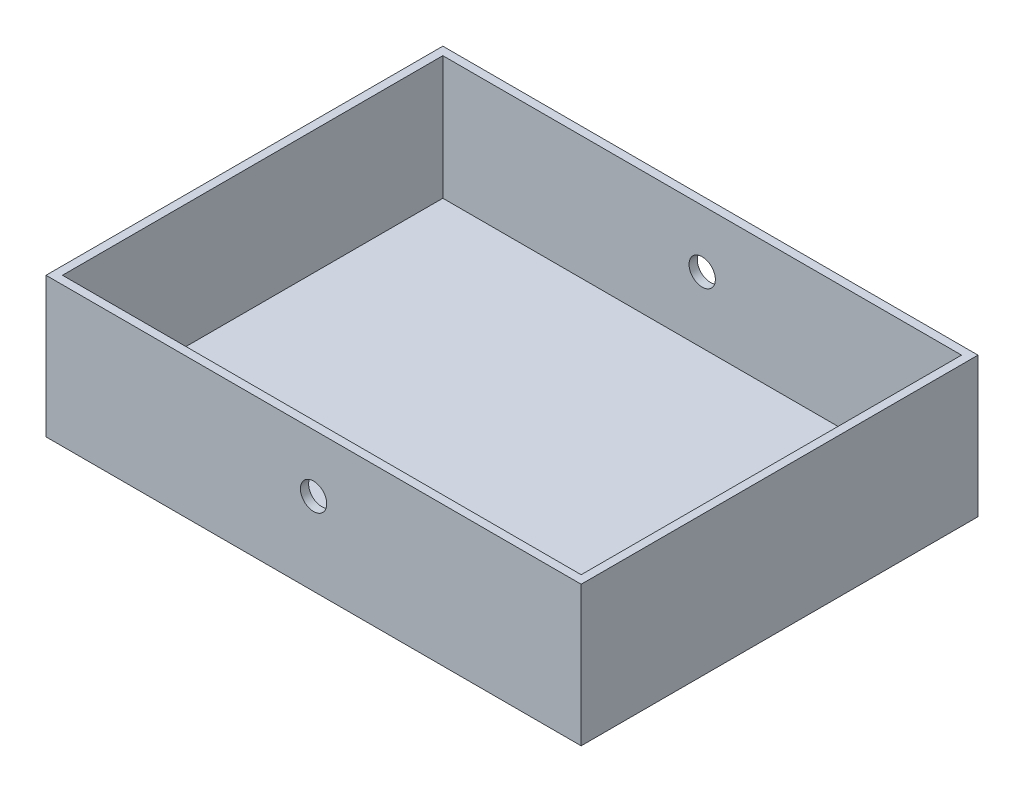
ISO-10303-21;
HEADER;
FILE_DESCRIPTION(('STEP AP214'),'2;1');
FILE_NAME('part.step','',(''),(''),'','','');
FILE_SCHEMA(('AUTOMOTIVE_DESIGN { 1 0 10303 214 1 1 1 1 }'));
ENDSEC;
DATA;
#1=APPLICATION_CONTEXT('core data for automotive mechanical design processes');
#2=APPLICATION_PROTOCOL_DEFINITION('international standard','automotive_design',2000,#1);
#3=PRODUCT_CONTEXT('',#1,'mechanical');
#4=PRODUCT('Part','Part','',(#3));
#5=PRODUCT_RELATED_PRODUCT_CATEGORY('part','',(#4));
#6=PRODUCT_DEFINITION_FORMATION('','',#4);
#7=PRODUCT_DEFINITION_CONTEXT('part definition',#1,'design');
#8=PRODUCT_DEFINITION('design','',#6,#7);
#9=PRODUCT_DEFINITION_SHAPE('','',#8);
#10=(LENGTH_UNIT() NAMED_UNIT(*) SI_UNIT(.MILLI.,.METRE.));
#11=(NAMED_UNIT(*) PLANE_ANGLE_UNIT() SI_UNIT($,.RADIAN.));
#12=(NAMED_UNIT(*) SI_UNIT($,.STERADIAN.) SOLID_ANGLE_UNIT());
#13=UNCERTAINTY_MEASURE_WITH_UNIT(LENGTH_MEASURE(1.E-05),#10,'distance_accuracy_value','');
#14=(GEOMETRIC_REPRESENTATION_CONTEXT(3) GLOBAL_UNCERTAINTY_ASSIGNED_CONTEXT((#13)) GLOBAL_UNIT_ASSIGNED_CONTEXT((#10,
#11,#12)) REPRESENTATION_CONTEXT('',''));
#15=CARTESIAN_POINT('',(0.,0.,0.));
#16=DIRECTION('',(0.,0.,1.));
#17=DIRECTION('',(1.,0.,0.));
#18=AXIS2_PLACEMENT_3D('',#15,#16,#17);
#19=CARTESIAN_POINT('',(0.,14.9999999999999,482.));
#20=DIRECTION('',(0.,0.,-1.));
#21=DIRECTION('',(-1.,0.,0.));
#22=AXIS2_PLACEMENT_3D('',#19,#20,#21);
#23=CYLINDRICAL_SURFACE('',#22,16.);
#24=CARTESIAN_POINT('',(0.,14.9999999999999,472.));
#25=DIRECTION('',(0.,0.,1.));
#26=DIRECTION('',(1.,0.,0.));
#27=AXIS2_PLACEMENT_3D('',#24,#25,#26);
#28=CIRCLE('',#27,16.);
#29=CARTESIAN_POINT('',(16.,14.9999999999999,472.));
#30=VERTEX_POINT('',#29);
#31=EDGE_CURVE('E47',#30,#30,#28,.F.);
#32=ORIENTED_EDGE('',*,*,#31,.T.);
#33=EDGE_LOOP('',(#32));
#34=FACE_BOUND('',#33,.T.);
#35=CARTESIAN_POINT('',(0.,14.9999999999999,482.));
#36=DIRECTION('',(0.,0.,-1.));
#37=DIRECTION('',(-1.,0.,0.));
#38=AXIS2_PLACEMENT_3D('',#35,#36,#37);
#39=CIRCLE('',#38,16.);
#40=CARTESIAN_POINT('',(-16.,14.9999999999999,482.));
#41=VERTEX_POINT('',#40);
#42=EDGE_CURVE('E159',#41,#41,#39,.T.);
#43=ORIENTED_EDGE('',*,*,#42,.F.);
#44=EDGE_LOOP('',(#43));
#45=FACE_BOUND('',#44,.T.);
#46=ADVANCED_FACE('F43',(#34,#45),#23,.F.);
#47=CARTESIAN_POINT('',(-325.,-85.0000000000001,482.));
#48=DIRECTION('',(1.,0.,0.));
#49=DIRECTION('',(0.,0.,-1.));
#50=AXIS2_PLACEMENT_3D('',#47,#48,#49);
#51=PLANE('',#50);
#52=DIRECTION('',(0.,-1.,0.));
#53=VECTOR('',#52,1.);
#54=CARTESIAN_POINT('',(-325.,-85.0000000000001,0.));
#55=LINE('',#54,#53);
#56=CARTESIAN_POINT('',(-325.,85.,0.));
#57=VERTEX_POINT('',#56);
#58=CARTESIAN_POINT('',(-325.,-85.0000000000001,0.));
#59=VERTEX_POINT('',#58);
#60=EDGE_CURVE('E162',#57,#59,#55,.T.);
#61=ORIENTED_EDGE('',*,*,#60,.T.);
#62=DIRECTION('',(0.,0.,-1.));
#63=VECTOR('',#62,1.);
#64=CARTESIAN_POINT('',(-325.,-85.0000000000001,482.));
#65=LINE('',#64,#63);
#66=CARTESIAN_POINT('',(-325.,-85.0000000000001,482.));
#67=VERTEX_POINT('',#66);
#68=EDGE_CURVE('E11',#67,#59,#65,.T.);
#69=ORIENTED_EDGE('',*,*,#68,.F.);
#70=DIRECTION('',(0.,-1.,0.));
#71=VECTOR('',#70,1.);
#72=CARTESIAN_POINT('',(-325.,-85.0000000000001,482.));
#73=LINE('',#72,#71);
#74=CARTESIAN_POINT('',(-325.,85.,482.));
#75=VERTEX_POINT('',#74);
#76=EDGE_CURVE('E166',#75,#67,#73,.T.);
#77=ORIENTED_EDGE('',*,*,#76,.F.);
#78=DIRECTION('',(0.,0.,-1.));
#79=VECTOR('',#78,1.);
#80=CARTESIAN_POINT('',(-325.,85.,482.));
#81=LINE('',#80,#79);
#82=EDGE_CURVE('E172',#75,#57,#81,.T.);
#83=ORIENTED_EDGE('',*,*,#82,.T.);
#84=EDGE_LOOP('',(#61,#69,#77,#83));
#85=FACE_BOUND('',#84,.T.);
#86=ADVANCED_FACE('F45',(#85),#51,.F.);
#87=CARTESIAN_POINT('',(325.,-85.,482.));
#88=DIRECTION('',(0.,1.,0.));
#89=DIRECTION('',(-1.,0.,0.));
#90=AXIS2_PLACEMENT_3D('',#87,#88,#89);
#91=PLANE('',#90);
#92=DIRECTION('',(1.,0.,0.));
#93=VECTOR('',#92,1.);
#94=CARTESIAN_POINT('',(325.,-85.,0.));
#95=LINE('',#94,#93);
#96=CARTESIAN_POINT('',(325.,-85.,0.));
#97=VERTEX_POINT('',#96);
#98=EDGE_CURVE('E175',#59,#97,#95,.T.);
#99=ORIENTED_EDGE('',*,*,#98,.T.);
#100=DIRECTION('',(0.,0.,-1.));
#101=VECTOR('',#100,1.);
#102=CARTESIAN_POINT('',(325.,-85.,482.));
#103=LINE('',#102,#101);
#104=CARTESIAN_POINT('',(325.,-85.,482.));
#105=VERTEX_POINT('',#104);
#106=EDGE_CURVE('E52',#105,#97,#103,.T.);
#107=ORIENTED_EDGE('',*,*,#106,.F.);
#108=DIRECTION('',(1.,0.,0.));
#109=VECTOR('',#108,1.);
#110=CARTESIAN_POINT('',(325.,-85.,482.));
#111=LINE('',#110,#109);
#112=EDGE_CURVE('E97',#67,#105,#111,.T.);
#113=ORIENTED_EDGE('',*,*,#112,.F.);
#114=ORIENTED_EDGE('',*,*,#68,.T.);
#115=EDGE_LOOP('',(#99,#107,#113,#114));
#116=FACE_BOUND('',#115,.T.);
#117=ADVANCED_FACE('F212',(#116),#91,.F.);
#118=CARTESIAN_POINT('',(325.,-85.,482.));
#119=DIRECTION('',(-1.,0.,0.));
#120=DIRECTION('',(0.,0.,1.));
#121=AXIS2_PLACEMENT_3D('',#118,#119,#120);
#122=PLANE('',#121);
#123=DIRECTION('',(0.,1.,0.));
#124=VECTOR('',#123,1.);
#125=CARTESIAN_POINT('',(325.,-85.,0.));
#126=LINE('',#125,#124);
#127=CARTESIAN_POINT('',(325.,85.,0.));
#128=VERTEX_POINT('',#127);
#129=EDGE_CURVE('E177',#97,#128,#126,.T.);
#130=ORIENTED_EDGE('',*,*,#129,.T.);
#131=DIRECTION('',(0.,0.,-1.));
#132=VECTOR('',#131,1.);
#133=CARTESIAN_POINT('',(325.,85.,482.));
#134=LINE('',#133,#132);
#135=CARTESIAN_POINT('',(325.,85.,482.));
#136=VERTEX_POINT('',#135);
#137=EDGE_CURVE('E181',#136,#128,#134,.T.);
#138=ORIENTED_EDGE('',*,*,#137,.F.);
#139=DIRECTION('',(0.,1.,0.));
#140=VECTOR('',#139,1.);
#141=CARTESIAN_POINT('',(325.,-85.,482.));
#142=LINE('',#141,#140);
#143=EDGE_CURVE('E169',#105,#136,#142,.T.);
#144=ORIENTED_EDGE('',*,*,#143,.F.);
#145=ORIENTED_EDGE('',*,*,#106,.T.);
#146=EDGE_LOOP('',(#130,#138,#144,#145));
#147=FACE_BOUND('',#146,.T.);
#148=ADVANCED_FACE('F224',(#147),#122,.F.);
#149=CARTESIAN_POINT('',(325.,85.,482.));
#150=DIRECTION('',(0.,-1.,0.));
#151=DIRECTION('',(1.,0.,0.));
#152=AXIS2_PLACEMENT_3D('',#149,#150,#151);
#153=PLANE('',#152);
#154=DIRECTION('',(-1.,0.,0.));
#155=VECTOR('',#154,1.);
#156=CARTESIAN_POINT('',(-315.,85.,10.));
#157=LINE('',#156,#155);
#158=CARTESIAN_POINT('',(315.,85.,10.));
#159=VERTEX_POINT('',#158);
#160=CARTESIAN_POINT('',(-315.,85.,10.));
#161=VERTEX_POINT('',#160);
#162=EDGE_CURVE('E149',#159,#161,#157,.T.);
#163=ORIENTED_EDGE('',*,*,#162,.F.);
#164=DIRECTION('',(0.,0.,-1.));
#165=VECTOR('',#164,1.);
#166=CARTESIAN_POINT('',(315.,85.,472.));
#167=LINE('',#166,#165);
#168=CARTESIAN_POINT('',(315.,85.,472.));
#169=VERTEX_POINT('',#168);
#170=EDGE_CURVE('E60',#169,#159,#167,.T.);
#171=ORIENTED_EDGE('',*,*,#170,.F.);
#172=DIRECTION('',(1.,0.,0.));
#173=VECTOR('',#172,1.);
#174=CARTESIAN_POINT('',(-315.,85.,472.));
#175=LINE('',#174,#173);
#176=CARTESIAN_POINT('',(-315.,85.,472.));
#177=VERTEX_POINT('',#176);
#178=EDGE_CURVE('E140',#177,#169,#175,.T.);
#179=ORIENTED_EDGE('',*,*,#178,.F.);
#180=DIRECTION('',(0.,0.,1.));
#181=VECTOR('',#180,1.);
#182=CARTESIAN_POINT('',(-315.,85.,472.));
#183=LINE('',#182,#181);
#184=EDGE_CURVE('E143',#161,#177,#183,.T.);
#185=ORIENTED_EDGE('',*,*,#184,.F.);
#186=EDGE_LOOP('',(#163,#171,#179,#185));
#187=FACE_BOUND('',#186,.T.);
#188=DIRECTION('',(-1.,0.,0.));
#189=VECTOR('',#188,1.);
#190=CARTESIAN_POINT('',(325.,85.,0.));
#191=LINE('',#190,#189);
#192=EDGE_CURVE('E90',#128,#57,#191,.T.);
#193=ORIENTED_EDGE('',*,*,#192,.T.);
#194=ORIENTED_EDGE('',*,*,#82,.F.);
#195=DIRECTION('',(-1.,0.,0.));
#196=VECTOR('',#195,1.);
#197=CARTESIAN_POINT('',(325.,85.,482.));
#198=LINE('',#197,#196);
#199=EDGE_CURVE('E69',#136,#75,#198,.T.);
#200=ORIENTED_EDGE('',*,*,#199,.F.);
#201=ORIENTED_EDGE('',*,*,#137,.T.);
#202=EDGE_LOOP('',(#193,#194,#200,#201));
#203=FACE_BOUND('',#202,.T.);
#204=ADVANCED_FACE('F219',(#187,#203),#153,.F.);
#205=CARTESIAN_POINT('',(0.,0.,482.));
#206=DIRECTION('',(0.,0.,1.));
#207=DIRECTION('',(1.,0.,0.));
#208=AXIS2_PLACEMENT_3D('',#205,#206,#207);
#209=PLANE('',#208);
#210=ORIENTED_EDGE('',*,*,#42,.T.);
#211=EDGE_LOOP('',(#210));
#212=FACE_BOUND('',#211,.T.);
#213=ORIENTED_EDGE('',*,*,#76,.T.);
#214=ORIENTED_EDGE('',*,*,#112,.T.);
#215=ORIENTED_EDGE('',*,*,#143,.T.);
#216=ORIENTED_EDGE('',*,*,#199,.T.);
#217=EDGE_LOOP('',(#213,#214,#215,#216));
#218=FACE_BOUND('',#217,.T.);
#219=ADVANCED_FACE('F216',(#212,#218),#209,.T.);
#220=CARTESIAN_POINT('',(0.,0.,0.));
#221=DIRECTION('',(0.,0.,1.));
#222=DIRECTION('',(1.,0.,0.));
#223=AXIS2_PLACEMENT_3D('',#220,#221,#222);
#224=PLANE('',#223);
#225=CARTESIAN_POINT('',(0.,14.9999999999999,0.));
#226=DIRECTION('',(0.,0.,-1.));
#227=DIRECTION('',(-1.,0.,0.));
#228=AXIS2_PLACEMENT_3D('',#225,#226,#227);
#229=CIRCLE('',#228,16.);
#230=CARTESIAN_POINT('',(-16.,14.9999999999999,0.));
#231=VERTEX_POINT('',#230);
#232=EDGE_CURVE('E163',#231,#231,#229,.T.);
#233=ORIENTED_EDGE('',*,*,#232,.F.);
#234=EDGE_LOOP('',(#233));
#235=FACE_BOUND('',#234,.T.);
#236=ORIENTED_EDGE('',*,*,#60,.F.);
#237=ORIENTED_EDGE('',*,*,#192,.F.);
#238=ORIENTED_EDGE('',*,*,#129,.F.);
#239=ORIENTED_EDGE('',*,*,#98,.F.);
#240=EDGE_LOOP('',(#236,#237,#238,#239));
#241=FACE_BOUND('',#240,.T.);
#242=ADVANCED_FACE('F202',(#235,#241),#224,.F.);
#243=CARTESIAN_POINT('',(0.,14.9999999999999,10.));
#244=DIRECTION('',(0.,0.,-1.));
#245=DIRECTION('',(-1.,0.,0.));
#246=AXIS2_PLACEMENT_3D('',#243,#244,#245);
#247=CIRCLE('',#246,16.);
#248=CARTESIAN_POINT('',(-16.,14.9999999999999,10.));
#249=VERTEX_POINT('',#248);
#250=EDGE_CURVE('E155',#249,#249,#247,.F.);
#251=ORIENTED_EDGE('',*,*,#250,.T.);
#252=EDGE_LOOP('',(#251));
#253=FACE_BOUND('',#252,.T.);
#254=ORIENTED_EDGE('',*,*,#232,.T.);
#255=EDGE_LOOP('',(#254));
#256=FACE_BOUND('',#255,.T.);
#257=ADVANCED_FACE('F194',(#253,#256),#23,.F.);
#258=CARTESIAN_POINT('',(-315.,-65.,472.));
#259=DIRECTION('',(0.,0.,1.));
#260=DIRECTION('',(1.,0.,0.));
#261=AXIS2_PLACEMENT_3D('',#258,#259,#260);
#262=PLANE('',#261);
#263=ORIENTED_EDGE('',*,*,#178,.T.);
#264=DIRECTION('',(0.,1.,0.));
#265=VECTOR('',#264,1.);
#266=CARTESIAN_POINT('',(315.,-65.,472.));
#267=LINE('',#266,#265);
#268=CARTESIAN_POINT('',(315.,-65.,472.));
#269=VERTEX_POINT('',#268);
#270=EDGE_CURVE('E153',#269,#169,#267,.T.);
#271=ORIENTED_EDGE('',*,*,#270,.F.);
#272=DIRECTION('',(1.,0.,0.));
#273=VECTOR('',#272,1.);
#274=CARTESIAN_POINT('',(-315.,-65.,472.));
#275=LINE('',#274,#273);
#276=CARTESIAN_POINT('',(-315.,-65.,472.));
#277=VERTEX_POINT('',#276);
#278=EDGE_CURVE('E127',#277,#269,#275,.T.);
#279=ORIENTED_EDGE('',*,*,#278,.F.);
#280=DIRECTION('',(0.,1.,0.));
#281=VECTOR('',#280,1.);
#282=CARTESIAN_POINT('',(-315.,-65.,472.));
#283=LINE('',#282,#281);
#284=EDGE_CURVE('E156',#277,#177,#283,.T.);
#285=ORIENTED_EDGE('',*,*,#284,.T.);
#286=EDGE_LOOP('',(#263,#271,#279,#285));
#287=FACE_BOUND('',#286,.T.);
#288=ORIENTED_EDGE('',*,*,#31,.F.);
#289=EDGE_LOOP('',(#288));
#290=FACE_BOUND('',#289,.T.);
#291=ADVANCED_FACE('F192',(#287,#290),#262,.F.);
#292=CARTESIAN_POINT('',(-315.,-65.,10.));
#293=DIRECTION('',(0.,0.,-1.));
#294=DIRECTION('',(-1.,0.,0.));
#295=AXIS2_PLACEMENT_3D('',#292,#293,#294);
#296=PLANE('',#295);
#297=ORIENTED_EDGE('',*,*,#162,.T.);
#298=DIRECTION('',(0.,1.,0.));
#299=VECTOR('',#298,1.);
#300=CARTESIAN_POINT('',(-315.,-65.,10.));
#301=LINE('',#300,#299);
#302=CARTESIAN_POINT('',(-315.,-65.,10.));
#303=VERTEX_POINT('',#302);
#304=EDGE_CURVE('E126',#303,#161,#301,.T.);
#305=ORIENTED_EDGE('',*,*,#304,.F.);
#306=DIRECTION('',(-1.,0.,0.));
#307=VECTOR('',#306,1.);
#308=CARTESIAN_POINT('',(-315.,-65.,10.));
#309=LINE('',#308,#307);
#310=CARTESIAN_POINT('',(315.,-65.,10.));
#311=VERTEX_POINT('',#310);
#312=EDGE_CURVE('E130',#311,#303,#309,.T.);
#313=ORIENTED_EDGE('',*,*,#312,.F.);
#314=DIRECTION('',(0.,1.,0.));
#315=VECTOR('',#314,1.);
#316=CARTESIAN_POINT('',(315.,-65.,10.));
#317=LINE('',#316,#315);
#318=EDGE_CURVE('E117',#311,#159,#317,.T.);
#319=ORIENTED_EDGE('',*,*,#318,.T.);
#320=EDGE_LOOP('',(#297,#305,#313,#319));
#321=FACE_BOUND('',#320,.T.);
#322=ORIENTED_EDGE('',*,*,#250,.F.);
#323=EDGE_LOOP('',(#322));
#324=FACE_BOUND('',#323,.T.);
#325=ADVANCED_FACE('F131',(#321,#324),#296,.F.);
#326=CARTESIAN_POINT('',(315.,-65.,472.));
#327=DIRECTION('',(1.,0.,0.));
#328=DIRECTION('',(0.,1.,0.));
#329=AXIS2_PLACEMENT_3D('',#326,#327,#328);
#330=PLANE('',#329);
#331=ORIENTED_EDGE('',*,*,#170,.T.);
#332=ORIENTED_EDGE('',*,*,#318,.F.);
#333=DIRECTION('',(0.,0.,-1.));
#334=VECTOR('',#333,1.);
#335=CARTESIAN_POINT('',(315.,-65.,472.));
#336=LINE('',#335,#334);
#337=EDGE_CURVE('E121',#269,#311,#336,.T.);
#338=ORIENTED_EDGE('',*,*,#337,.F.);
#339=ORIENTED_EDGE('',*,*,#270,.T.);
#340=EDGE_LOOP('',(#331,#332,#338,#339));
#341=FACE_BOUND('',#340,.T.);
#342=ADVANCED_FACE('F119',(#341),#330,.F.);
#343=CARTESIAN_POINT('',(-315.,-65.,472.));
#344=DIRECTION('',(-1.,0.,0.));
#345=DIRECTION('',(0.,-1.,0.));
#346=AXIS2_PLACEMENT_3D('',#343,#344,#345);
#347=PLANE('',#346);
#348=ORIENTED_EDGE('',*,*,#184,.T.);
#349=ORIENTED_EDGE('',*,*,#284,.F.);
#350=DIRECTION('',(0.,0.,1.));
#351=VECTOR('',#350,1.);
#352=CARTESIAN_POINT('',(-315.,-65.,472.));
#353=LINE('',#352,#351);
#354=EDGE_CURVE('E136',#303,#277,#353,.T.);
#355=ORIENTED_EDGE('',*,*,#354,.F.);
#356=ORIENTED_EDGE('',*,*,#304,.T.);
#357=EDGE_LOOP('',(#348,#349,#355,#356));
#358=FACE_BOUND('',#357,.T.);
#359=ADVANCED_FACE('F272',(#358),#347,.F.);
#360=CARTESIAN_POINT('',(0.,-65.,0.));
#361=DIRECTION('',(0.,-1.,0.));
#362=DIRECTION('',(1.,0.,0.));
#363=AXIS2_PLACEMENT_3D('',#360,#361,#362);
#364=PLANE('',#363);
#365=ORIENTED_EDGE('',*,*,#337,.T.);
#366=ORIENTED_EDGE('',*,*,#312,.T.);
#367=ORIENTED_EDGE('',*,*,#354,.T.);
#368=ORIENTED_EDGE('',*,*,#278,.T.);
#369=EDGE_LOOP('',(#365,#366,#367,#368));
#370=FACE_BOUND('',#369,.T.);
#371=ADVANCED_FACE('F138',(#370),#364,.F.);
#372=CLOSED_SHELL('',(#46,#86,#117,#148,#204,#219,#242,#257,#291,#325,#342,#359,#371));
#373=MANIFOLD_SOLID_BREP('B2',#372);
#374=ADVANCED_BREP_SHAPE_REPRESENTATION('',(#18,#373),#14);
#375=SHAPE_DEFINITION_REPRESENTATION(#9,#374);
ENDSEC;
END-ISO-10303-21;
